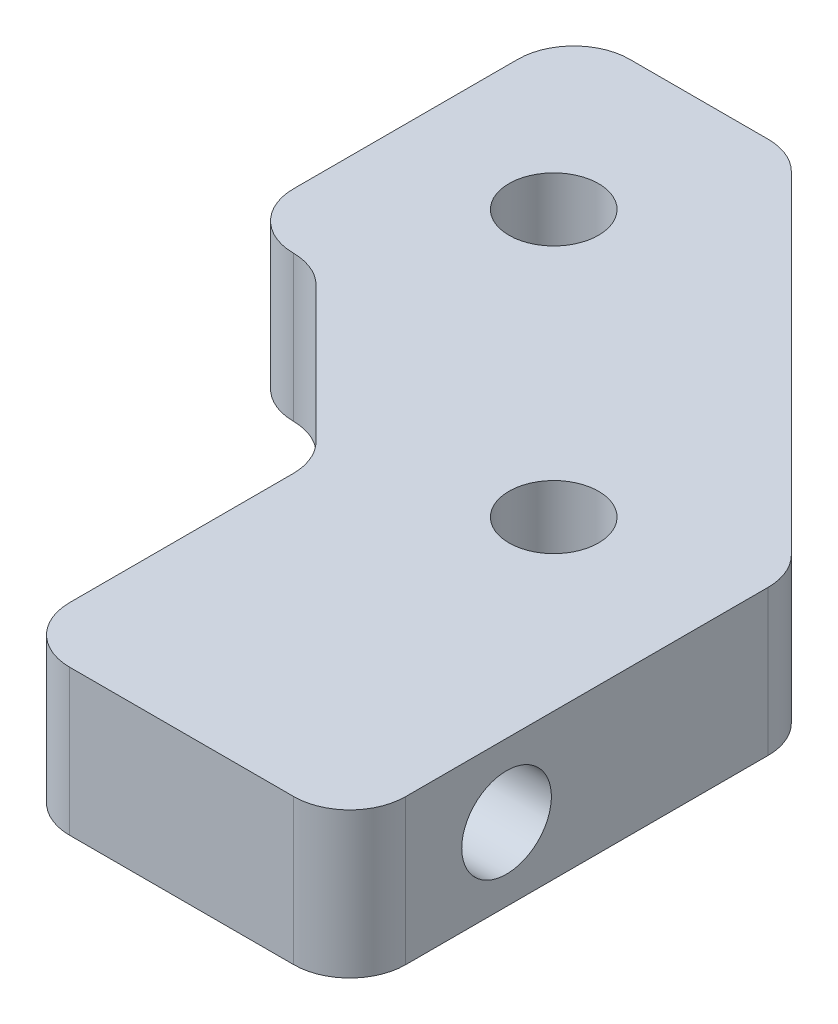
ISO-10303-21;
HEADER;
FILE_DESCRIPTION(('STEP AP214'),'2;1');
FILE_NAME('part.step','',(''),(''),'','','');
FILE_SCHEMA(('AUTOMOTIVE_DESIGN { 1 0 10303 214 1 1 1 1 }'));
ENDSEC;
DATA;
#1=APPLICATION_CONTEXT('core data for automotive mechanical design processes');
#2=APPLICATION_PROTOCOL_DEFINITION('international standard','automotive_design',2000,#1);
#3=PRODUCT_CONTEXT('',#1,'mechanical');
#4=PRODUCT('Part','Part','',(#3));
#5=PRODUCT_RELATED_PRODUCT_CATEGORY('part','',(#4));
#6=PRODUCT_DEFINITION_FORMATION('','',#4);
#7=PRODUCT_DEFINITION_CONTEXT('part definition',#1,'design');
#8=PRODUCT_DEFINITION('design','',#6,#7);
#9=PRODUCT_DEFINITION_SHAPE('','',#8);
#10=(LENGTH_UNIT() NAMED_UNIT(*) SI_UNIT(.MILLI.,.METRE.));
#11=(NAMED_UNIT(*) PLANE_ANGLE_UNIT() SI_UNIT($,.RADIAN.));
#12=(NAMED_UNIT(*) SI_UNIT($,.STERADIAN.) SOLID_ANGLE_UNIT());
#13=UNCERTAINTY_MEASURE_WITH_UNIT(LENGTH_MEASURE(1.E-05),#10,'distance_accuracy_value','');
#14=(GEOMETRIC_REPRESENTATION_CONTEXT(3) GLOBAL_UNCERTAINTY_ASSIGNED_CONTEXT((#13)) GLOBAL_UNIT_ASSIGNED_CONTEXT((#10,
#11,#12)) REPRESENTATION_CONTEXT('',''));
#15=CARTESIAN_POINT('',(0.,0.,0.));
#16=DIRECTION('',(0.,0.,1.));
#17=DIRECTION('',(1.,0.,0.));
#18=AXIS2_PLACEMENT_3D('',#15,#16,#17);
#19=CARTESIAN_POINT('',(-22.,13.,0.));
#20=DIRECTION('',(0.,-1.,0.));
#21=DIRECTION('',(0.,0.,-1.));
#22=AXIS2_PLACEMENT_3D('',#19,#20,#21);
#23=PLANE('',#22);
#24=CARTESIAN_POINT('',(-8.78679656440375,13.,-15.0000000000002));
#25=DIRECTION('',(0.,1.,0.));
#26=DIRECTION('',(0.,0.,1.));
#27=AXIS2_PLACEMENT_3D('',#24,#25,#26);
#28=CIRCLE('',#27,4.);
#29=CARTESIAN_POINT('',(-8.78679656440375,13.,-11.0000000000002));
#30=VERTEX_POINT('',#29);
#31=EDGE_CURVE('E176',#30,#30,#28,.T.);
#32=ORIENTED_EDGE('',*,*,#31,.F.);
#33=EDGE_LOOP('',(#32));
#34=FACE_BOUND('',#33,.T.);
#35=DIRECTION('',(-1.,0.,0.));
#36=VECTOR('',#35,1.);
#37=CARTESIAN_POINT('',(-22.,13.,-30.));
#38=LINE('',#37,#36);
#39=CARTESIAN_POINT('',(-4.64466094067263,13.,-30.));
#40=VERTEX_POINT('',#39);
#41=CARTESIAN_POINT('',(-17.,13.,-30.));
#42=VERTEX_POINT('',#41);
#43=EDGE_CURVE('E247',#40,#42,#38,.T.);
#44=ORIENTED_EDGE('',*,*,#43,.T.);
#45=CARTESIAN_POINT('',(-17.,13.,-25.));
#46=DIRECTION('',(0.,-1.,0.));
#47=DIRECTION('',(0.,0.,-1.));
#48=AXIS2_PLACEMENT_3D('',#45,#46,#47);
#49=CIRCLE('',#48,5.);
#50=CARTESIAN_POINT('',(-22.,13.,-25.));
#51=VERTEX_POINT('',#50);
#52=EDGE_CURVE('E39',#42,#51,#49,.F.);
#53=ORIENTED_EDGE('',*,*,#52,.T.);
#54=DIRECTION('',(0.,0.,1.));
#55=VECTOR('',#54,1.);
#56=CARTESIAN_POINT('',(-22.,13.,0.));
#57=LINE('',#56,#55);
#58=CARTESIAN_POINT('',(-22.,13.,-4.99974746511738));
#59=VERTEX_POINT('',#58);
#60=EDGE_CURVE('E191',#51,#59,#57,.T.);
#61=ORIENTED_EDGE('',*,*,#60,.T.);
#62=CARTESIAN_POINT('',(-17.,13.,-4.99974746511738));
#63=DIRECTION('',(0.,-1.,0.));
#64=DIRECTION('',(0.,0.,-1.));
#65=AXIS2_PLACEMENT_3D('',#62,#63,#64);
#66=CIRCLE('',#65,5.);
#67=CARTESIAN_POINT('',(-17.0355339059329,13.,0.000126267441182513));
#68=VERTEX_POINT('',#67);
#69=EDGE_CURVE('E46',#59,#68,#66,.F.);
#70=ORIENTED_EDGE('',*,*,#69,.T.);
#71=CARTESIAN_POINT('',(-17.0710678118657,13.,4.99999999999975));
#72=DIRECTION('',(0.,-1.,0.));
#73=DIRECTION('',(0.,0.,-1.));
#74=AXIS2_PLACEMENT_3D('',#71,#72,#73);
#75=CIRCLE('',#74,5.);
#76=CARTESIAN_POINT('',(-13.535533905933,13.,1.46446609406701));
#77=VERTEX_POINT('',#76);
#78=EDGE_CURVE('E232',#68,#77,#75,.T.);
#79=ORIENTED_EDGE('',*,*,#78,.T.);
#80=DIRECTION('',(0.707106781186548,0.,0.707106781186547));
#81=VECTOR('',#80,1.);
#82=CARTESIAN_POINT('',(0.,13.,15.));
#83=LINE('',#82,#81);
#84=CARTESIAN_POINT('',(-1.46446609406723,13.,13.5355339059328));
#85=VERTEX_POINT('',#84);
#86=EDGE_CURVE('E190',#77,#85,#83,.T.);
#87=ORIENTED_EDGE('',*,*,#86,.T.);
#88=CARTESIAN_POINT('',(-4.99999999999997,13.,17.0710678118655));
#89=DIRECTION('',(0.,-1.,0.));
#90=DIRECTION('',(0.,0.,-1.));
#91=AXIS2_PLACEMENT_3D('',#88,#89,#90);
#92=CIRCLE('',#91,5.);
#93=CARTESIAN_POINT('',(0.,13.,17.0710678118654));
#94=VERTEX_POINT('',#93);
#95=EDGE_CURVE('E151',#85,#94,#92,.T.);
#96=ORIENTED_EDGE('',*,*,#95,.T.);
#97=DIRECTION('',(0.,0.,1.));
#98=VECTOR('',#97,1.);
#99=CARTESIAN_POINT('',(3.59318883378181E-13,13.,42.0000000000011));
#100=LINE('',#99,#98);
#101=CARTESIAN_POINT('',(2.93118529085691E-13,13.,37.0000000000011));
#102=VERTEX_POINT('',#101);
#103=EDGE_CURVE('E161',#94,#102,#100,.T.);
#104=ORIENTED_EDGE('',*,*,#103,.T.);
#105=CARTESIAN_POINT('',(5.00000000000029,13.,37.000000000001));
#106=DIRECTION('',(0.,-1.,0.));
#107=DIRECTION('',(0.,0.,-1.));
#108=AXIS2_PLACEMENT_3D('',#105,#106,#107);
#109=CIRCLE('',#108,5.);
#110=CARTESIAN_POINT('',(5.00000000000037,13.,42.000000000001));
#111=VERTEX_POINT('',#110);
#112=EDGE_CURVE('E213',#102,#111,#109,.F.);
#113=ORIENTED_EDGE('',*,*,#112,.T.);
#114=DIRECTION('',(1.,0.,0.));
#115=VECTOR('',#114,1.);
#116=CARTESIAN_POINT('',(3.59318883378181E-13,13.,42.0000000000011));
#117=LINE('',#116,#115);
#118=CARTESIAN_POINT('',(24.9999999999995,13.,42.0000000000007));
#119=VERTEX_POINT('',#118);
#120=EDGE_CURVE('E288',#111,#119,#117,.T.);
#121=ORIENTED_EDGE('',*,*,#120,.T.);
#122=CARTESIAN_POINT('',(24.9999999999994,13.,37.0000000000007));
#123=DIRECTION('',(0.,-1.,0.));
#124=DIRECTION('',(0.,0.,-1.));
#125=AXIS2_PLACEMENT_3D('',#122,#123,#124);
#126=CIRCLE('',#125,5.);
#127=CARTESIAN_POINT('',(29.9999999999994,13.,37.0000000000007));
#128=VERTEX_POINT('',#127);
#129=EDGE_CURVE('E219',#119,#128,#126,.F.);
#130=ORIENTED_EDGE('',*,*,#129,.T.);
#131=DIRECTION('',(0.,0.,-1.));
#132=VECTOR('',#131,1.);
#133=CARTESIAN_POINT('',(29.9999999999994,13.,2.5735931288066));
#134=LINE('',#133,#132);
#135=CARTESIAN_POINT('',(29.9999999999994,13.,4.64466094067208));
#136=VERTEX_POINT('',#135);
#137=EDGE_CURVE('E278',#128,#136,#134,.T.);
#138=ORIENTED_EDGE('',*,*,#137,.T.);
#139=CARTESIAN_POINT('',(24.9999999999994,13.,4.64466094067208));
#140=DIRECTION('',(0.,-1.,0.));
#141=DIRECTION('',(0.,0.,-1.));
#142=AXIS2_PLACEMENT_3D('',#139,#140,#141);
#143=CIRCLE('',#142,5.);
#144=CARTESIAN_POINT('',(28.5355339059322,13.,1.10912703473934));
#145=VERTEX_POINT('',#144);
#146=EDGE_CURVE('E217',#136,#145,#143,.F.);
#147=ORIENTED_EDGE('',*,*,#146,.T.);
#148=DIRECTION('',(-0.707106781186548,0.,-0.707106781186548));
#149=VECTOR('',#148,1.);
#150=CARTESIAN_POINT('',(-2.57359312880715,13.,-30.));
#151=LINE('',#150,#149);
#152=CARTESIAN_POINT('',(-1.10912703473989,13.,-28.5355339059327));
#153=VERTEX_POINT('',#152);
#154=EDGE_CURVE('E267',#145,#153,#151,.T.);
#155=ORIENTED_EDGE('',*,*,#154,.T.);
#156=CARTESIAN_POINT('',(-4.64466094067263,13.,-25.));
#157=DIRECTION('',(0.,-1.,0.));
#158=DIRECTION('',(0.,0.,-1.));
#159=AXIS2_PLACEMENT_3D('',#156,#157,#158);
#160=CIRCLE('',#159,5.);
#161=EDGE_CURVE('E215',#153,#40,#160,.F.);
#162=ORIENTED_EDGE('',*,*,#161,.T.);
#163=EDGE_LOOP('',(#44,#53,#61,#70,#79,#87,#96,#104,#113,#121,#130,#138,#147,#155,#162));
#164=FACE_BOUND('',#163,.T.);
#165=CARTESIAN_POINT('',(14.9999999999997,13.,8.7867965644033));
#166=DIRECTION('',(0.,1.,0.));
#167=DIRECTION('',(0.,0.,1.));
#168=AXIS2_PLACEMENT_3D('',#165,#166,#167);
#169=CIRCLE('',#168,4.);
#170=CARTESIAN_POINT('',(14.9999999999997,13.,12.7867965644033));
#171=VERTEX_POINT('',#170);
#172=EDGE_CURVE('E303',#171,#171,#169,.T.);
#173=ORIENTED_EDGE('',*,*,#172,.F.);
#174=EDGE_LOOP('',(#173));
#175=FACE_BOUND('',#174,.T.);
#176=ADVANCED_FACE('F31',(#34,#164,#175),#23,.F.);
#177=CARTESIAN_POINT('',(-22.,0.,0.));
#178=DIRECTION('',(0.,-1.,0.));
#179=DIRECTION('',(0.,0.,-1.));
#180=AXIS2_PLACEMENT_3D('',#177,#178,#179);
#181=PLANE('',#180);
#182=CARTESIAN_POINT('',(-8.78679656440375,0.,-15.0000000000002));
#183=DIRECTION('',(0.,1.,0.));
#184=DIRECTION('',(0.,0.,1.));
#185=AXIS2_PLACEMENT_3D('',#182,#183,#184);
#186=CIRCLE('',#185,4.);
#187=CARTESIAN_POINT('',(-8.78679656440375,0.,-11.0000000000002));
#188=VERTEX_POINT('',#187);
#189=EDGE_CURVE('E300',#188,#188,#186,.T.);
#190=ORIENTED_EDGE('',*,*,#189,.T.);
#191=EDGE_LOOP('',(#190));
#192=FACE_BOUND('',#191,.T.);
#193=DIRECTION('',(0.,0.,1.));
#194=VECTOR('',#193,1.);
#195=CARTESIAN_POINT('',(-22.,0.,0.));
#196=LINE('',#195,#194);
#197=CARTESIAN_POINT('',(-22.,0.,-25.));
#198=VERTEX_POINT('',#197);
#199=CARTESIAN_POINT('',(-22.,0.,-4.99974746511738));
#200=VERTEX_POINT('',#199);
#201=EDGE_CURVE('E187',#198,#200,#196,.T.);
#202=ORIENTED_EDGE('',*,*,#201,.F.);
#203=CARTESIAN_POINT('',(-17.,0.,-25.));
#204=DIRECTION('',(0.,-1.,0.));
#205=DIRECTION('',(0.,0.,-1.));
#206=AXIS2_PLACEMENT_3D('',#203,#204,#205);
#207=CIRCLE('',#206,5.);
#208=CARTESIAN_POINT('',(-17.,0.,-30.));
#209=VERTEX_POINT('',#208);
#210=EDGE_CURVE('E241',#198,#209,#207,.T.);
#211=ORIENTED_EDGE('',*,*,#210,.T.);
#212=DIRECTION('',(-1.,0.,0.));
#213=VECTOR('',#212,1.);
#214=CARTESIAN_POINT('',(-22.,0.,-30.));
#215=LINE('',#214,#213);
#216=CARTESIAN_POINT('',(-4.64466094067263,0.,-30.));
#217=VERTEX_POINT('',#216);
#218=EDGE_CURVE('E185',#217,#209,#215,.T.);
#219=ORIENTED_EDGE('',*,*,#218,.F.);
#220=CARTESIAN_POINT('',(-4.64466094067263,0.,-25.));
#221=DIRECTION('',(0.,-1.,0.));
#222=DIRECTION('',(0.,0.,-1.));
#223=AXIS2_PLACEMENT_3D('',#220,#221,#222);
#224=CIRCLE('',#223,5.);
#225=CARTESIAN_POINT('',(-1.10912703473989,0.,-28.5355339059327));
#226=VERTEX_POINT('',#225);
#227=EDGE_CURVE('E202',#217,#226,#224,.T.);
#228=ORIENTED_EDGE('',*,*,#227,.T.);
#229=DIRECTION('',(-0.707106781186548,0.,-0.707106781186548));
#230=VECTOR('',#229,1.);
#231=CARTESIAN_POINT('',(-2.57359312880715,0.,-30.));
#232=LINE('',#231,#230);
#233=CARTESIAN_POINT('',(28.5355339059322,0.,1.10912703473934));
#234=VERTEX_POINT('',#233);
#235=EDGE_CURVE('E182',#234,#226,#232,.T.);
#236=ORIENTED_EDGE('',*,*,#235,.F.);
#237=CARTESIAN_POINT('',(24.9999999999994,0.,4.64466094067208));
#238=DIRECTION('',(0.,-1.,0.));
#239=DIRECTION('',(0.,0.,-1.));
#240=AXIS2_PLACEMENT_3D('',#237,#238,#239);
#241=CIRCLE('',#240,5.);
#242=CARTESIAN_POINT('',(29.9999999999994,0.,4.64466094067208));
#243=VERTEX_POINT('',#242);
#244=EDGE_CURVE('E204',#234,#243,#241,.T.);
#245=ORIENTED_EDGE('',*,*,#244,.T.);
#246=DIRECTION('',(0.,0.,-1.));
#247=VECTOR('',#246,1.);
#248=CARTESIAN_POINT('',(29.9999999999994,0.,2.5735931288066));
#249=LINE('',#248,#247);
#250=CARTESIAN_POINT('',(29.9999999999994,0.,37.0000000000007));
#251=VERTEX_POINT('',#250);
#252=EDGE_CURVE('E174',#251,#243,#249,.T.);
#253=ORIENTED_EDGE('',*,*,#252,.F.);
#254=CARTESIAN_POINT('',(24.9999999999994,0.,37.0000000000007));
#255=DIRECTION('',(0.,-1.,0.));
#256=DIRECTION('',(0.,0.,-1.));
#257=AXIS2_PLACEMENT_3D('',#254,#255,#256);
#258=CIRCLE('',#257,5.);
#259=CARTESIAN_POINT('',(24.9999999999995,0.,42.0000000000007));
#260=VERTEX_POINT('',#259);
#261=EDGE_CURVE('E206',#251,#260,#258,.T.);
#262=ORIENTED_EDGE('',*,*,#261,.T.);
#263=DIRECTION('',(1.,0.,0.));
#264=VECTOR('',#263,1.);
#265=CARTESIAN_POINT('',(3.59318883378181E-13,0.,42.0000000000011));
#266=LINE('',#265,#264);
#267=CARTESIAN_POINT('',(5.00000000000037,0.,42.000000000001));
#268=VERTEX_POINT('',#267);
#269=EDGE_CURVE('E170',#268,#260,#266,.T.);
#270=ORIENTED_EDGE('',*,*,#269,.F.);
#271=CARTESIAN_POINT('',(5.00000000000029,0.,37.000000000001));
#272=DIRECTION('',(0.,-1.,0.));
#273=DIRECTION('',(0.,0.,-1.));
#274=AXIS2_PLACEMENT_3D('',#271,#272,#273);
#275=CIRCLE('',#274,5.);
#276=CARTESIAN_POINT('',(2.93118529085691E-13,0.,37.0000000000011));
#277=VERTEX_POINT('',#276);
#278=EDGE_CURVE('E169',#268,#277,#275,.T.);
#279=ORIENTED_EDGE('',*,*,#278,.T.);
#280=DIRECTION('',(0.,0.,1.));
#281=VECTOR('',#280,1.);
#282=CARTESIAN_POINT('',(3.59318883378181E-13,0.,42.0000000000011));
#283=LINE('',#282,#281);
#284=CARTESIAN_POINT('',(0.,0.,17.0710678118654));
#285=VERTEX_POINT('',#284);
#286=EDGE_CURVE('E158',#285,#277,#283,.T.);
#287=ORIENTED_EDGE('',*,*,#286,.F.);
#288=CARTESIAN_POINT('',(-4.99999999999997,0.,17.0710678118655));
#289=DIRECTION('',(0.,-1.,0.));
#290=DIRECTION('',(0.,0.,-1.));
#291=AXIS2_PLACEMENT_3D('',#288,#289,#290);
#292=CIRCLE('',#291,5.);
#293=CARTESIAN_POINT('',(-1.46446609406723,0.,13.5355339059328));
#294=VERTEX_POINT('',#293);
#295=EDGE_CURVE('E141',#285,#294,#292,.F.);
#296=ORIENTED_EDGE('',*,*,#295,.T.);
#297=DIRECTION('',(0.707106781186548,0.,0.707106781186547));
#298=VECTOR('',#297,1.);
#299=CARTESIAN_POINT('',(0.,0.,15.));
#300=LINE('',#299,#298);
#301=CARTESIAN_POINT('',(-13.535533905933,0.,1.46446609406701));
#302=VERTEX_POINT('',#301);
#303=EDGE_CURVE('E171',#302,#294,#300,.T.);
#304=ORIENTED_EDGE('',*,*,#303,.F.);
#305=CARTESIAN_POINT('',(-17.0710678118657,0.,4.99999999999975));
#306=DIRECTION('',(0.,-1.,0.));
#307=DIRECTION('',(0.,0.,-1.));
#308=AXIS2_PLACEMENT_3D('',#305,#306,#307);
#309=CIRCLE('',#308,5.);
#310=CARTESIAN_POINT('',(-17.0355339059329,0.,0.000126267441182513));
#311=VERTEX_POINT('',#310);
#312=EDGE_CURVE('E229',#302,#311,#309,.F.);
#313=ORIENTED_EDGE('',*,*,#312,.T.);
#314=CARTESIAN_POINT('',(-17.,0.,-4.99974746511738));
#315=DIRECTION('',(0.,-1.,0.));
#316=DIRECTION('',(0.,0.,-1.));
#317=AXIS2_PLACEMENT_3D('',#314,#315,#316);
#318=CIRCLE('',#317,5.);
#319=EDGE_CURVE('E239',#311,#200,#318,.T.);
#320=ORIENTED_EDGE('',*,*,#319,.T.);
#321=EDGE_LOOP('',(#202,#211,#219,#228,#236,#245,#253,#262,#270,#279,#287,#296,#304,#313,#320));
#322=FACE_BOUND('',#321,.T.);
#323=CARTESIAN_POINT('',(14.9999999999997,0.,8.7867965644033));
#324=DIRECTION('',(0.,1.,0.));
#325=DIRECTION('',(0.,0.,1.));
#326=AXIS2_PLACEMENT_3D('',#323,#324,#325);
#327=CIRCLE('',#326,4.);
#328=CARTESIAN_POINT('',(14.9999999999997,0.,12.7867965644033));
#329=VERTEX_POINT('',#328);
#330=EDGE_CURVE('E306',#329,#329,#327,.T.);
#331=ORIENTED_EDGE('',*,*,#330,.T.);
#332=EDGE_LOOP('',(#331));
#333=FACE_BOUND('',#332,.T.);
#334=ADVANCED_FACE('F166',(#192,#322,#333),#181,.T.);
#335=CARTESIAN_POINT('',(0.,13.,15.));
#336=DIRECTION('',(0.707106781186547,0.,-0.707106781186548));
#337=DIRECTION('',(-0.707106781186548,0.,-0.707106781186547));
#338=AXIS2_PLACEMENT_3D('',#335,#336,#337);
#339=PLANE('',#338);
#340=ORIENTED_EDGE('',*,*,#303,.T.);
#341=DIRECTION('',(0.,-1.,0.));
#342=VECTOR('',#341,1.);
#343=CARTESIAN_POINT('',(-1.46446609406723,13.,13.5355339059328));
#344=LINE('',#343,#342);
#345=EDGE_CURVE('E146',#294,#85,#344,.F.);
#346=ORIENTED_EDGE('',*,*,#345,.T.);
#347=ORIENTED_EDGE('',*,*,#86,.F.);
#348=DIRECTION('',(0.,-1.,0.));
#349=VECTOR('',#348,1.);
#350=CARTESIAN_POINT('',(-13.535533905933,0.,1.46446609406701));
#351=LINE('',#350,#349);
#352=EDGE_CURVE('E162',#77,#302,#351,.T.);
#353=ORIENTED_EDGE('',*,*,#352,.T.);
#354=EDGE_LOOP('',(#340,#346,#347,#353));
#355=FACE_BOUND('',#354,.T.);
#356=ADVANCED_FACE('F326',(#355),#339,.F.);
#357=CARTESIAN_POINT('',(3.59318883378181E-13,13.,42.0000000000011));
#358=DIRECTION('',(1.,0.,0.));
#359=DIRECTION('',(0.,0.,-1.));
#360=AXIS2_PLACEMENT_3D('',#357,#358,#359);
#361=PLANE('',#360);
#362=CARTESIAN_POINT('',(0.,6.5,28.0000000000001));
#363=DIRECTION('',(-1.,0.,0.));
#364=DIRECTION('',(0.,0.,1.));
#365=AXIS2_PLACEMENT_3D('',#362,#363,#364);
#366=CIRCLE('',#365,4.);
#367=CARTESIAN_POINT('',(0.,6.5,32.0000000000001));
#368=VERTEX_POINT('',#367);
#369=EDGE_CURVE('E312',#368,#368,#366,.T.);
#370=ORIENTED_EDGE('',*,*,#369,.F.);
#371=EDGE_LOOP('',(#370));
#372=FACE_BOUND('',#371,.T.);
#373=ORIENTED_EDGE('',*,*,#103,.F.);
#374=DIRECTION('',(0.,-1.,0.));
#375=VECTOR('',#374,1.);
#376=CARTESIAN_POINT('',(0.,0.,17.0710678118654));
#377=LINE('',#376,#375);
#378=EDGE_CURVE('E145',#94,#285,#377,.T.);
#379=ORIENTED_EDGE('',*,*,#378,.T.);
#380=ORIENTED_EDGE('',*,*,#286,.T.);
#381=DIRECTION('',(0.,-1.,0.));
#382=VECTOR('',#381,1.);
#383=CARTESIAN_POINT('',(2.93118529085691E-13,13.,37.0000000000011));
#384=LINE('',#383,#382);
#385=EDGE_CURVE('E163',#277,#102,#384,.F.);
#386=ORIENTED_EDGE('',*,*,#385,.T.);
#387=EDGE_LOOP('',(#373,#379,#380,#386));
#388=FACE_BOUND('',#387,.T.);
#389=ADVANCED_FACE('F157',(#372,#388),#361,.F.);
#390=CARTESIAN_POINT('',(3.59318883378181E-13,13.,42.0000000000011));
#391=DIRECTION('',(0.,0.,-1.));
#392=DIRECTION('',(-1.,0.,0.));
#393=AXIS2_PLACEMENT_3D('',#390,#391,#392);
#394=PLANE('',#393);
#395=ORIENTED_EDGE('',*,*,#269,.T.);
#396=DIRECTION('',(0.,-1.,0.));
#397=VECTOR('',#396,1.);
#398=CARTESIAN_POINT('',(24.9999999999995,13.,42.0000000000007));
#399=LINE('',#398,#397);
#400=EDGE_CURVE('E211',#260,#119,#399,.F.);
#401=ORIENTED_EDGE('',*,*,#400,.T.);
#402=ORIENTED_EDGE('',*,*,#120,.F.);
#403=DIRECTION('',(0.,-1.,0.));
#404=VECTOR('',#403,1.);
#405=CARTESIAN_POINT('',(5.00000000000037,13.,42.000000000001));
#406=LINE('',#405,#404);
#407=EDGE_CURVE('E208',#111,#268,#406,.T.);
#408=ORIENTED_EDGE('',*,*,#407,.T.);
#409=EDGE_LOOP('',(#395,#401,#402,#408));
#410=FACE_BOUND('',#409,.T.);
#411=ADVANCED_FACE('F284',(#410),#394,.F.);
#412=CARTESIAN_POINT('',(29.9999999999994,13.,2.5735931288066));
#413=DIRECTION('',(-1.,0.,0.));
#414=DIRECTION('',(0.,0.,1.));
#415=AXIS2_PLACEMENT_3D('',#412,#413,#414);
#416=PLANE('',#415);
#417=CARTESIAN_POINT('',(30.,6.5,28.0000000000001));
#418=DIRECTION('',(-1.,0.,0.));
#419=DIRECTION('',(0.,0.,1.));
#420=AXIS2_PLACEMENT_3D('',#417,#418,#419);
#421=CIRCLE('',#420,4.);
#422=CARTESIAN_POINT('',(30.,6.5,32.0000000000001));
#423=VERTEX_POINT('',#422);
#424=EDGE_CURVE('E309',#423,#423,#421,.T.);
#425=ORIENTED_EDGE('',*,*,#424,.T.);
#426=EDGE_LOOP('',(#425));
#427=FACE_BOUND('',#426,.T.);
#428=ORIENTED_EDGE('',*,*,#137,.F.);
#429=DIRECTION('',(0.,-1.,0.));
#430=VECTOR('',#429,1.);
#431=CARTESIAN_POINT('',(29.9999999999994,13.,37.0000000000007));
#432=LINE('',#431,#430);
#433=EDGE_CURVE('E198',#128,#251,#432,.T.);
#434=ORIENTED_EDGE('',*,*,#433,.T.);
#435=ORIENTED_EDGE('',*,*,#252,.T.);
#436=DIRECTION('',(0.,-1.,0.));
#437=VECTOR('',#436,1.);
#438=CARTESIAN_POINT('',(29.9999999999994,13.,4.64466094067208));
#439=LINE('',#438,#437);
#440=EDGE_CURVE('E196',#243,#136,#439,.F.);
#441=ORIENTED_EDGE('',*,*,#440,.T.);
#442=EDGE_LOOP('',(#428,#434,#435,#441));
#443=FACE_BOUND('',#442,.T.);
#444=ADVANCED_FACE('F275',(#427,#443),#416,.F.);
#445=CARTESIAN_POINT('',(-2.57359312880715,13.,-30.));
#446=DIRECTION('',(-0.707106781186548,0.,0.707106781186548));
#447=DIRECTION('',(0.707106781186548,0.,0.707106781186548));
#448=AXIS2_PLACEMENT_3D('',#445,#446,#447);
#449=PLANE('',#448);
#450=ORIENTED_EDGE('',*,*,#154,.F.);
#451=DIRECTION('',(0.,-1.,0.));
#452=VECTOR('',#451,1.);
#453=CARTESIAN_POINT('',(28.5355339059322,13.,1.10912703473934));
#454=LINE('',#453,#452);
#455=EDGE_CURVE('E223',#145,#234,#454,.T.);
#456=ORIENTED_EDGE('',*,*,#455,.T.);
#457=ORIENTED_EDGE('',*,*,#235,.T.);
#458=DIRECTION('',(0.,-1.,0.));
#459=VECTOR('',#458,1.);
#460=CARTESIAN_POINT('',(-1.10912703473989,13.,-28.5355339059327));
#461=LINE('',#460,#459);
#462=EDGE_CURVE('E221',#226,#153,#461,.F.);
#463=ORIENTED_EDGE('',*,*,#462,.T.);
#464=EDGE_LOOP('',(#450,#456,#457,#463));
#465=FACE_BOUND('',#464,.T.);
#466=ADVANCED_FACE('F264',(#465),#449,.F.);
#467=CARTESIAN_POINT('',(-22.,13.,-30.));
#468=DIRECTION('',(0.,0.,1.));
#469=DIRECTION('',(1.,0.,0.));
#470=AXIS2_PLACEMENT_3D('',#467,#468,#469);
#471=PLANE('',#470);
#472=ORIENTED_EDGE('',*,*,#218,.T.);
#473=DIRECTION('',(0.,-1.,0.));
#474=VECTOR('',#473,1.);
#475=CARTESIAN_POINT('',(-17.,13.,-30.));
#476=LINE('',#475,#474);
#477=EDGE_CURVE('E54',#209,#42,#476,.F.);
#478=ORIENTED_EDGE('',*,*,#477,.T.);
#479=ORIENTED_EDGE('',*,*,#43,.F.);
#480=DIRECTION('',(0.,-1.,0.));
#481=VECTOR('',#480,1.);
#482=CARTESIAN_POINT('',(-4.64466094067263,13.,-30.));
#483=LINE('',#482,#481);
#484=EDGE_CURVE('E152',#40,#217,#483,.T.);
#485=ORIENTED_EDGE('',*,*,#484,.T.);
#486=EDGE_LOOP('',(#472,#478,#479,#485));
#487=FACE_BOUND('',#486,.T.);
#488=ADVANCED_FACE('F255',(#487),#471,.F.);
#489=CARTESIAN_POINT('',(-22.,13.,0.));
#490=DIRECTION('',(1.,0.,0.));
#491=DIRECTION('',(0.,0.,-1.));
#492=AXIS2_PLACEMENT_3D('',#489,#490,#491);
#493=PLANE('',#492);
#494=ORIENTED_EDGE('',*,*,#60,.F.);
#495=DIRECTION('',(0.,-1.,0.));
#496=VECTOR('',#495,1.);
#497=CARTESIAN_POINT('',(-22.,13.,-25.));
#498=LINE('',#497,#496);
#499=EDGE_CURVE('E236',#51,#198,#498,.T.);
#500=ORIENTED_EDGE('',*,*,#499,.T.);
#501=ORIENTED_EDGE('',*,*,#201,.T.);
#502=DIRECTION('',(0.,1.,0.));
#503=VECTOR('',#502,1.);
#504=CARTESIAN_POINT('',(-22.,13.,-4.99974746511738));
#505=LINE('',#504,#503);
#506=EDGE_CURVE('E234',#200,#59,#505,.T.);
#507=ORIENTED_EDGE('',*,*,#506,.T.);
#508=EDGE_LOOP('',(#494,#500,#501,#507));
#509=FACE_BOUND('',#508,.T.);
#510=ADVANCED_FACE('F251',(#509),#493,.F.);
#511=CARTESIAN_POINT('',(-8.78679656440375,13.,-15.0000000000002));
#512=DIRECTION('',(0.,-1.,0.));
#513=DIRECTION('',(0.,0.,-1.));
#514=AXIS2_PLACEMENT_3D('',#511,#512,#513);
#515=CYLINDRICAL_SURFACE('',#514,4.);
#516=ORIENTED_EDGE('',*,*,#31,.T.);
#517=EDGE_LOOP('',(#516));
#518=FACE_BOUND('',#517,.T.);
#519=ORIENTED_EDGE('',*,*,#189,.F.);
#520=EDGE_LOOP('',(#519));
#521=FACE_BOUND('',#520,.T.);
#522=ADVANCED_FACE('F345',(#518,#521),#515,.F.);
#523=CARTESIAN_POINT('',(14.9999999999997,13.,8.7867965644033));
#524=DIRECTION('',(0.,-1.,0.));
#525=DIRECTION('',(0.,0.,-1.));
#526=AXIS2_PLACEMENT_3D('',#523,#524,#525);
#527=CYLINDRICAL_SURFACE('',#526,4.);
#528=ORIENTED_EDGE('',*,*,#172,.T.);
#529=EDGE_LOOP('',(#528));
#530=FACE_BOUND('',#529,.T.);
#531=ORIENTED_EDGE('',*,*,#330,.F.);
#532=EDGE_LOOP('',(#531));
#533=FACE_BOUND('',#532,.T.);
#534=ADVANCED_FACE('F381',(#530,#533),#527,.F.);
#535=CARTESIAN_POINT('',(-4.99999999999997,13.,17.0710678118655));
#536=DIRECTION('',(0.,1.,0.));
#537=DIRECTION('',(0.,0.,1.));
#538=AXIS2_PLACEMENT_3D('',#535,#536,#537);
#539=CYLINDRICAL_SURFACE('',#538,5.);
#540=ORIENTED_EDGE('',*,*,#95,.F.);
#541=ORIENTED_EDGE('',*,*,#345,.F.);
#542=ORIENTED_EDGE('',*,*,#295,.F.);
#543=ORIENTED_EDGE('',*,*,#378,.F.);
#544=EDGE_LOOP('',(#540,#541,#542,#543));
#545=FACE_BOUND('',#544,.T.);
#546=ADVANCED_FACE('F144',(#545),#539,.F.);
#547=CARTESIAN_POINT('',(24.9999999999994,13.,37.0000000000007));
#548=DIRECTION('',(0.,-1.,0.));
#549=DIRECTION('',(0.,0.,-1.));
#550=AXIS2_PLACEMENT_3D('',#547,#548,#549);
#551=CYLINDRICAL_SURFACE('',#550,5.);
#552=ORIENTED_EDGE('',*,*,#129,.F.);
#553=ORIENTED_EDGE('',*,*,#400,.F.);
#554=ORIENTED_EDGE('',*,*,#261,.F.);
#555=ORIENTED_EDGE('',*,*,#433,.F.);
#556=EDGE_LOOP('',(#552,#553,#554,#555));
#557=FACE_BOUND('',#556,.T.);
#558=ADVANCED_FACE('F281',(#557),#551,.T.);
#559=CARTESIAN_POINT('',(24.9999999999994,13.,4.64466094067208));
#560=DIRECTION('',(0.,-1.,0.));
#561=DIRECTION('',(0.,0.,-1.));
#562=AXIS2_PLACEMENT_3D('',#559,#560,#561);
#563=CYLINDRICAL_SURFACE('',#562,5.);
#564=ORIENTED_EDGE('',*,*,#146,.F.);
#565=ORIENTED_EDGE('',*,*,#440,.F.);
#566=ORIENTED_EDGE('',*,*,#244,.F.);
#567=ORIENTED_EDGE('',*,*,#455,.F.);
#568=EDGE_LOOP('',(#564,#565,#566,#567));
#569=FACE_BOUND('',#568,.T.);
#570=ADVANCED_FACE('F270',(#569),#563,.T.);
#571=CARTESIAN_POINT('',(-4.64466094067263,13.,-25.));
#572=DIRECTION('',(0.,-1.,0.));
#573=DIRECTION('',(0.,0.,-1.));
#574=AXIS2_PLACEMENT_3D('',#571,#572,#573);
#575=CYLINDRICAL_SURFACE('',#574,5.);
#576=ORIENTED_EDGE('',*,*,#161,.F.);
#577=ORIENTED_EDGE('',*,*,#462,.F.);
#578=ORIENTED_EDGE('',*,*,#227,.F.);
#579=ORIENTED_EDGE('',*,*,#484,.F.);
#580=EDGE_LOOP('',(#576,#577,#578,#579));
#581=FACE_BOUND('',#580,.T.);
#582=ADVANCED_FACE('F259',(#581),#575,.T.);
#583=CARTESIAN_POINT('',(-17.0710678118657,13.,4.99999999999975));
#584=DIRECTION('',(0.,1.,0.));
#585=DIRECTION('',(0.,0.,1.));
#586=AXIS2_PLACEMENT_3D('',#583,#584,#585);
#587=CYLINDRICAL_SURFACE('',#586,5.);
#588=ORIENTED_EDGE('',*,*,#78,.F.);
#589=DIRECTION('',(0.,1.,0.));
#590=VECTOR('',#589,1.);
#591=CARTESIAN_POINT('',(-17.0355339059329,13.,0.000126267441181646));
#592=LINE('',#591,#590);
#593=EDGE_CURVE('E11',#68,#311,#592,.F.);
#594=ORIENTED_EDGE('',*,*,#593,.T.);
#595=ORIENTED_EDGE('',*,*,#312,.F.);
#596=ORIENTED_EDGE('',*,*,#352,.F.);
#597=EDGE_LOOP('',(#588,#594,#595,#596));
#598=FACE_BOUND('',#597,.T.);
#599=ADVANCED_FACE('F412',(#598),#587,.F.);
#600=CARTESIAN_POINT('',(5.00000000000029,13.,37.000000000001));
#601=DIRECTION('',(0.,-1.,0.));
#602=DIRECTION('',(0.,0.,-1.));
#603=AXIS2_PLACEMENT_3D('',#600,#601,#602);
#604=CYLINDRICAL_SURFACE('',#603,5.);
#605=ORIENTED_EDGE('',*,*,#112,.F.);
#606=ORIENTED_EDGE('',*,*,#385,.F.);
#607=ORIENTED_EDGE('',*,*,#278,.F.);
#608=ORIENTED_EDGE('',*,*,#407,.F.);
#609=EDGE_LOOP('',(#605,#606,#607,#608));
#610=FACE_BOUND('',#609,.T.);
#611=ADVANCED_FACE('F291',(#610),#604,.T.);
#612=CARTESIAN_POINT('',(-17.,13.,-25.));
#613=DIRECTION('',(0.,-1.,0.));
#614=DIRECTION('',(0.,0.,-1.));
#615=AXIS2_PLACEMENT_3D('',#612,#613,#614);
#616=CYLINDRICAL_SURFACE('',#615,5.);
#617=ORIENTED_EDGE('',*,*,#52,.F.);
#618=ORIENTED_EDGE('',*,*,#477,.F.);
#619=ORIENTED_EDGE('',*,*,#210,.F.);
#620=ORIENTED_EDGE('',*,*,#499,.F.);
#621=EDGE_LOOP('',(#617,#618,#619,#620));
#622=FACE_BOUND('',#621,.T.);
#623=ADVANCED_FACE('F253',(#622),#616,.T.);
#624=CARTESIAN_POINT('',(-17.,13.,-4.99974746511738));
#625=DIRECTION('',(0.,1.,0.));
#626=DIRECTION('',(0.,0.,1.));
#627=AXIS2_PLACEMENT_3D('',#624,#625,#626);
#628=CYLINDRICAL_SURFACE('',#627,5.);
#629=ORIENTED_EDGE('',*,*,#69,.F.);
#630=ORIENTED_EDGE('',*,*,#506,.F.);
#631=ORIENTED_EDGE('',*,*,#319,.F.);
#632=ORIENTED_EDGE('',*,*,#593,.F.);
#633=EDGE_LOOP('',(#629,#630,#631,#632));
#634=FACE_BOUND('',#633,.T.);
#635=ADVANCED_FACE('F33',(#634),#628,.T.);
#636=CARTESIAN_POINT('',(30.,6.5,28.0000000000001));
#637=DIRECTION('',(-1.,0.,0.));
#638=DIRECTION('',(0.,0.,1.));
#639=AXIS2_PLACEMENT_3D('',#636,#637,#638);
#640=CYLINDRICAL_SURFACE('',#639,4.);
#641=ORIENTED_EDGE('',*,*,#424,.F.);
#642=EDGE_LOOP('',(#641));
#643=FACE_BOUND('',#642,.T.);
#644=ORIENTED_EDGE('',*,*,#369,.T.);
#645=EDGE_LOOP('',(#644));
#646=FACE_BOUND('',#645,.T.);
#647=ADVANCED_FACE('F319',(#643,#646),#640,.F.);
#648=CLOSED_SHELL('',(#176,#334,#356,#389,#411,#444,#466,#488,#510,#522,#534,#546,#558,#570,
#582,#599,#611,#623,#635,#647));
#649=MANIFOLD_SOLID_BREP('B2',#648);
#650=ADVANCED_BREP_SHAPE_REPRESENTATION('',(#18,#649),#14);
#651=SHAPE_DEFINITION_REPRESENTATION(#9,#650);
ENDSEC;
END-ISO-10303-21;
